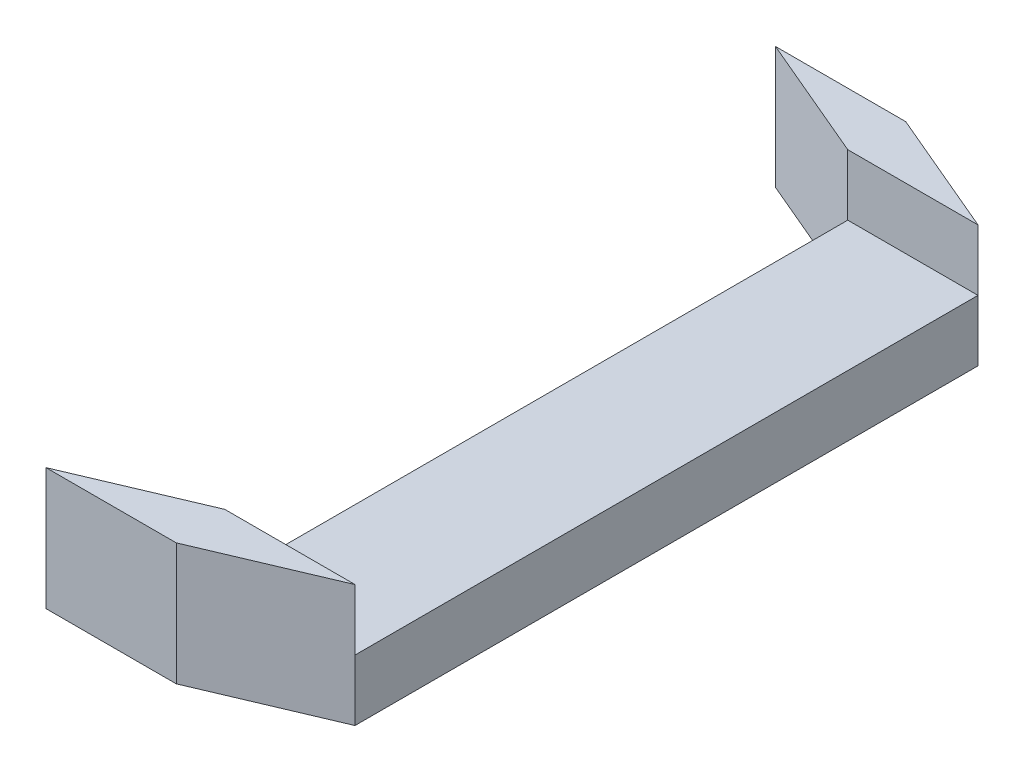
ISO-10303-21;
HEADER;
FILE_DESCRIPTION(('STEP AP214'),'2;1');
FILE_NAME('part.step','',(''),(''),'','','');
FILE_SCHEMA(('AUTOMOTIVE_DESIGN { 1 0 10303 214 1 1 1 1 }'));
ENDSEC;
DATA;
#1=APPLICATION_CONTEXT('core data for automotive mechanical design processes');
#2=APPLICATION_PROTOCOL_DEFINITION('international standard','automotive_design',2000,#1);
#3=PRODUCT_CONTEXT('',#1,'mechanical');
#4=PRODUCT('Part','Part','',(#3));
#5=PRODUCT_RELATED_PRODUCT_CATEGORY('part','',(#4));
#6=PRODUCT_DEFINITION_FORMATION('','',#4);
#7=PRODUCT_DEFINITION_CONTEXT('part definition',#1,'design');
#8=PRODUCT_DEFINITION('design','',#6,#7);
#9=PRODUCT_DEFINITION_SHAPE('','',#8);
#10=(LENGTH_UNIT() NAMED_UNIT(*) SI_UNIT(.MILLI.,.METRE.));
#11=(NAMED_UNIT(*) PLANE_ANGLE_UNIT() SI_UNIT($,.RADIAN.));
#12=(NAMED_UNIT(*) SI_UNIT($,.STERADIAN.) SOLID_ANGLE_UNIT());
#13=UNCERTAINTY_MEASURE_WITH_UNIT(LENGTH_MEASURE(1.E-05),#10,'distance_accuracy_value','');
#14=(GEOMETRIC_REPRESENTATION_CONTEXT(3) GLOBAL_UNCERTAINTY_ASSIGNED_CONTEXT((#13)) GLOBAL_UNIT_ASSIGNED_CONTEXT((#10,
#11,#12)) REPRESENTATION_CONTEXT('',''));
#15=CARTESIAN_POINT('',(0.,0.,0.));
#16=DIRECTION('',(0.,0.,1.));
#17=DIRECTION('',(1.,0.,0.));
#18=AXIS2_PLACEMENT_3D('',#15,#16,#17);
#19=CARTESIAN_POINT('',(3.2,3.,0.));
#20=DIRECTION('',(1.,0.,0.));
#21=DIRECTION('',(0.,0.,-1.));
#22=AXIS2_PLACEMENT_3D('',#19,#20,#21);
#23=PLANE('',#22);
#24=DIRECTION('',(0.,0.,1.));
#25=VECTOR('',#24,1.);
#26=CARTESIAN_POINT('',(3.2,0.,0.));
#27=LINE('',#26,#25);
#28=CARTESIAN_POINT('',(3.2,0.,-15.305));
#29=VERTEX_POINT('',#28);
#30=CARTESIAN_POINT('',(3.2,0.,15.305));
#31=VERTEX_POINT('',#30);
#32=EDGE_CURVE('E176',#29,#31,#27,.T.);
#33=ORIENTED_EDGE('',*,*,#32,.F.);
#34=DIRECTION('',(0.,-1.,0.));
#35=VECTOR('',#34,1.);
#36=CARTESIAN_POINT('',(3.2,3.,-15.305));
#37=LINE('',#36,#35);
#38=CARTESIAN_POINT('',(3.2,3.,-15.305));
#39=VERTEX_POINT('',#38);
#40=EDGE_CURVE('E11',#39,#29,#37,.T.);
#41=ORIENTED_EDGE('',*,*,#40,.F.);
#42=DIRECTION('',(0.,0.,1.));
#43=VECTOR('',#42,1.);
#44=CARTESIAN_POINT('',(3.2,3.,0.));
#45=LINE('',#44,#43);
#46=CARTESIAN_POINT('',(3.2,3.,15.305));
#47=VERTEX_POINT('',#46);
#48=EDGE_CURVE('E177',#39,#47,#45,.T.);
#49=ORIENTED_EDGE('',*,*,#48,.T.);
#50=DIRECTION('',(0.,-1.,0.));
#51=VECTOR('',#50,1.);
#52=CARTESIAN_POINT('',(3.2,3.,15.305));
#53=LINE('',#52,#51);
#54=EDGE_CURVE('E190',#47,#31,#53,.T.);
#55=ORIENTED_EDGE('',*,*,#54,.T.);
#56=EDGE_LOOP('',(#33,#41,#49,#55));
#57=FACE_BOUND('',#56,.T.);
#58=ADVANCED_FACE('F45',(#57),#23,.T.);
#59=CARTESIAN_POINT('',(-3.2,3.,0.));
#60=DIRECTION('',(1.,0.,0.));
#61=DIRECTION('',(0.,0.,-1.));
#62=AXIS2_PLACEMENT_3D('',#59,#60,#61);
#63=PLANE('',#62);
#64=DIRECTION('',(0.,0.,1.));
#65=VECTOR('',#64,1.);
#66=CARTESIAN_POINT('',(-3.2,0.,0.));
#67=LINE('',#66,#65);
#68=CARTESIAN_POINT('',(-3.2,0.,-15.305));
#69=VERTEX_POINT('',#68);
#70=CARTESIAN_POINT('',(-3.2,0.,15.305));
#71=VERTEX_POINT('',#70);
#72=EDGE_CURVE('E181',#69,#71,#67,.T.);
#73=ORIENTED_EDGE('',*,*,#72,.T.);
#74=DIRECTION('',(0.,-1.,0.));
#75=VECTOR('',#74,1.);
#76=CARTESIAN_POINT('',(-3.2,3.,15.305));
#77=LINE('',#76,#75);
#78=CARTESIAN_POINT('',(-3.2,3.,15.305));
#79=VERTEX_POINT('',#78);
#80=EDGE_CURVE('E197',#79,#71,#77,.T.);
#81=ORIENTED_EDGE('',*,*,#80,.F.);
#82=DIRECTION('',(0.,0.,1.));
#83=VECTOR('',#82,1.);
#84=CARTESIAN_POINT('',(-3.2,3.,0.));
#85=LINE('',#84,#83);
#86=CARTESIAN_POINT('',(-3.2,3.,-15.305));
#87=VERTEX_POINT('',#86);
#88=EDGE_CURVE('E184',#87,#79,#85,.T.);
#89=ORIENTED_EDGE('',*,*,#88,.F.);
#90=DIRECTION('',(0.,-1.,0.));
#91=VECTOR('',#90,1.);
#92=CARTESIAN_POINT('',(-3.2,3.,-15.305));
#93=LINE('',#92,#91);
#94=EDGE_CURVE('E52',#87,#69,#93,.T.);
#95=ORIENTED_EDGE('',*,*,#94,.T.);
#96=EDGE_LOOP('',(#73,#81,#89,#95));
#97=FACE_BOUND('',#96,.T.);
#98=ADVANCED_FACE('F202',(#97),#63,.F.);
#99=CARTESIAN_POINT('',(0.,3.,0.));
#100=DIRECTION('',(0.,1.,0.));
#101=DIRECTION('',(0.,0.,1.));
#102=AXIS2_PLACEMENT_3D('',#99,#100,#101);
#103=PLANE('',#102);
#104=ORIENTED_EDGE('',*,*,#48,.F.);
#105=DIRECTION('',(-1.,0.,0.));
#106=VECTOR('',#105,1.);
#107=CARTESIAN_POINT('',(0.,3.,-15.305));
#108=LINE('',#107,#106);
#109=EDGE_CURVE('E180',#39,#87,#108,.T.);
#110=ORIENTED_EDGE('',*,*,#109,.T.);
#111=ORIENTED_EDGE('',*,*,#88,.T.);
#112=DIRECTION('',(1.,0.,0.));
#113=VECTOR('',#112,1.);
#114=CARTESIAN_POINT('',(0.,3.,15.305));
#115=LINE('',#114,#113);
#116=EDGE_CURVE('E187',#79,#47,#115,.T.);
#117=ORIENTED_EDGE('',*,*,#116,.T.);
#118=EDGE_LOOP('',(#104,#110,#111,#117));
#119=FACE_BOUND('',#118,.T.);
#120=ADVANCED_FACE('F217',(#119),#103,.T.);
#121=CARTESIAN_POINT('',(0.,0.,0.));
#122=DIRECTION('',(0.,1.,0.));
#123=DIRECTION('',(0.,0.,1.));
#124=AXIS2_PLACEMENT_3D('',#121,#122,#123);
#125=PLANE('',#124);
#126=ORIENTED_EDGE('',*,*,#32,.T.);
#127=DIRECTION('',(-0.92050485345244,0.,0.390731128489274));
#128=VECTOR('',#127,1.);
#129=CARTESIAN_POINT('',(5.99329442935714,0.,14.1193168604793));
#130=LINE('',#129,#128);
#131=CARTESIAN_POINT('',(-2.96615493768854,0.,17.9223774838953));
#132=VERTEX_POINT('',#131);
#133=EDGE_CURVE('E145',#31,#132,#130,.T.);
#134=ORIENTED_EDGE('',*,*,#133,.T.);
#135=DIRECTION('',(-1.,0.,0.));
#136=VECTOR('',#135,1.);
#137=CARTESIAN_POINT('',(0.,0.,17.9223774838953));
#138=LINE('',#137,#136);
#139=CARTESIAN_POINT('',(-9.36615493768854,0.,17.9223774838953));
#140=VERTEX_POINT('',#139);
#141=EDGE_CURVE('E157',#132,#140,#138,.T.);
#142=ORIENTED_EDGE('',*,*,#141,.T.);
#143=DIRECTION('',(-0.92050485345244,0.,0.390731128489274));
#144=VECTOR('',#143,1.);
#145=CARTESIAN_POINT('',(5.01620121482593,0.,11.8174294993956));
#146=LINE('',#145,#144);
#147=EDGE_CURVE('E148',#71,#140,#146,.T.);
#148=ORIENTED_EDGE('',*,*,#147,.F.);
#149=ORIENTED_EDGE('',*,*,#72,.F.);
#150=DIRECTION('',(-0.92050485345244,0.,-0.390731128489275));
#151=VECTOR('',#150,1.);
#152=CARTESIAN_POINT('',(5.01620121482593,0.,-11.8174294993956));
#153=LINE('',#152,#151);
#154=CARTESIAN_POINT('',(-9.36615493768854,0.,-17.9223774838953));
#155=VERTEX_POINT('',#154);
#156=EDGE_CURVE('E140',#69,#155,#153,.T.);
#157=ORIENTED_EDGE('',*,*,#156,.T.);
#158=DIRECTION('',(-1.,0.,0.));
#159=VECTOR('',#158,1.);
#160=CARTESIAN_POINT('',(0.,0.,-17.9223774838953));
#161=LINE('',#160,#159);
#162=CARTESIAN_POINT('',(-2.96615493768854,0.,-17.9223774838953));
#163=VERTEX_POINT('',#162);
#164=EDGE_CURVE('E224',#163,#155,#161,.T.);
#165=ORIENTED_EDGE('',*,*,#164,.F.);
#166=DIRECTION('',(-0.92050485345244,0.,-0.390731128489275));
#167=VECTOR('',#166,1.);
#168=CARTESIAN_POINT('',(5.99329442935715,0.,-14.1193168604793));
#169=LINE('',#168,#167);
#170=EDGE_CURVE('E144',#29,#163,#169,.T.);
#171=ORIENTED_EDGE('',*,*,#170,.F.);
#172=EDGE_LOOP('',(#126,#134,#142,#148,#149,#157,#165,#171));
#173=FACE_BOUND('',#172,.T.);
#174=ADVANCED_FACE('F208',(#173),#125,.F.);
#175=CARTESIAN_POINT('',(0.,6.,15.305));
#176=DIRECTION('',(0.,0.,-1.));
#177=DIRECTION('',(-1.,0.,0.));
#178=AXIS2_PLACEMENT_3D('',#175,#176,#177);
#179=PLANE('',#178);
#180=ORIENTED_EDGE('',*,*,#116,.F.);
#181=DIRECTION('',(0.,-1.,0.));
#182=VECTOR('',#181,1.);
#183=CARTESIAN_POINT('',(-3.2,6.,15.305));
#184=LINE('',#183,#182);
#185=CARTESIAN_POINT('',(-3.2,6.,15.305));
#186=VERTEX_POINT('',#185);
#187=EDGE_CURVE('E172',#186,#79,#184,.T.);
#188=ORIENTED_EDGE('',*,*,#187,.F.);
#189=DIRECTION('',(1.,0.,0.));
#190=VECTOR('',#189,1.);
#191=CARTESIAN_POINT('',(0.,6.,15.305));
#192=LINE('',#191,#190);
#193=CARTESIAN_POINT('',(3.2,6.,15.305));
#194=VERTEX_POINT('',#193);
#195=EDGE_CURVE('E156',#186,#194,#192,.T.);
#196=ORIENTED_EDGE('',*,*,#195,.T.);
#197=DIRECTION('',(0.,-1.,0.));
#198=VECTOR('',#197,1.);
#199=CARTESIAN_POINT('',(3.2,6.,15.305));
#200=LINE('',#199,#198);
#201=EDGE_CURVE('E59',#194,#47,#200,.T.);
#202=ORIENTED_EDGE('',*,*,#201,.T.);
#203=EDGE_LOOP('',(#180,#188,#196,#202));
#204=FACE_BOUND('',#203,.T.);
#205=ADVANCED_FACE('F250',(#204),#179,.T.);
#206=CARTESIAN_POINT('',(5.99329442935714,6.,14.1193168604793));
#207=DIRECTION('',(0.390731128489274,0.,0.92050485345244));
#208=DIRECTION('',(0.92050485345244,0.,-0.390731128489274));
#209=AXIS2_PLACEMENT_3D('',#206,#207,#208);
#210=PLANE('',#209);
#211=ORIENTED_EDGE('',*,*,#133,.F.);
#212=ORIENTED_EDGE('',*,*,#54,.F.);
#213=ORIENTED_EDGE('',*,*,#201,.F.);
#214=DIRECTION('',(-0.92050485345244,0.,0.390731128489274));
#215=VECTOR('',#214,1.);
#216=CARTESIAN_POINT('',(5.99329442935714,6.,14.1193168604793));
#217=LINE('',#216,#215);
#218=CARTESIAN_POINT('',(-2.96615493768854,6.,17.9223774838953));
#219=VERTEX_POINT('',#218);
#220=EDGE_CURVE('E153',#194,#219,#217,.T.);
#221=ORIENTED_EDGE('',*,*,#220,.T.);
#222=DIRECTION('',(0.,-1.,0.));
#223=VECTOR('',#222,1.);
#224=CARTESIAN_POINT('',(-2.96615493768854,6.,17.9223774838953));
#225=LINE('',#224,#223);
#226=EDGE_CURVE('E163',#219,#132,#225,.T.);
#227=ORIENTED_EDGE('',*,*,#226,.T.);
#228=EDGE_LOOP('',(#211,#212,#213,#221,#227));
#229=FACE_BOUND('',#228,.T.);
#230=ADVANCED_FACE('F252',(#229),#210,.T.);
#231=CARTESIAN_POINT('',(5.01620121482593,6.,11.8174294993956));
#232=DIRECTION('',(0.390731128489274,0.,0.92050485345244));
#233=DIRECTION('',(0.92050485345244,0.,-0.390731128489274));
#234=AXIS2_PLACEMENT_3D('',#231,#232,#233);
#235=PLANE('',#234);
#236=ORIENTED_EDGE('',*,*,#147,.T.);
#237=DIRECTION('',(0.,-1.,0.));
#238=VECTOR('',#237,1.);
#239=CARTESIAN_POINT('',(-9.36615493768854,6.,17.9223774838953));
#240=LINE('',#239,#238);
#241=CARTESIAN_POINT('',(-9.36615493768854,6.,17.9223774838953));
#242=VERTEX_POINT('',#241);
#243=EDGE_CURVE('E170',#242,#140,#240,.T.);
#244=ORIENTED_EDGE('',*,*,#243,.F.);
#245=DIRECTION('',(-0.92050485345244,0.,0.390731128489274));
#246=VECTOR('',#245,1.);
#247=CARTESIAN_POINT('',(5.01620121482593,6.,11.8174294993956));
#248=LINE('',#247,#246);
#249=EDGE_CURVE('E159',#186,#242,#248,.T.);
#250=ORIENTED_EDGE('',*,*,#249,.F.);
#251=ORIENTED_EDGE('',*,*,#187,.T.);
#252=ORIENTED_EDGE('',*,*,#80,.T.);
#253=EDGE_LOOP('',(#236,#244,#250,#251,#252));
#254=FACE_BOUND('',#253,.T.);
#255=ADVANCED_FACE('F212',(#254),#235,.F.);
#256=CARTESIAN_POINT('',(0.,6.,17.9223774838953));
#257=DIRECTION('',(0.,0.,1.));
#258=DIRECTION('',(1.,0.,0.));
#259=AXIS2_PLACEMENT_3D('',#256,#257,#258);
#260=PLANE('',#259);
#261=ORIENTED_EDGE('',*,*,#141,.F.);
#262=ORIENTED_EDGE('',*,*,#226,.F.);
#263=DIRECTION('',(-1.,0.,0.));
#264=VECTOR('',#263,1.);
#265=CARTESIAN_POINT('',(0.,6.,17.9223774838953));
#266=LINE('',#265,#264);
#267=EDGE_CURVE('E161',#219,#242,#266,.T.);
#268=ORIENTED_EDGE('',*,*,#267,.T.);
#269=ORIENTED_EDGE('',*,*,#243,.T.);
#270=EDGE_LOOP('',(#261,#262,#268,#269));
#271=FACE_BOUND('',#270,.T.);
#272=ADVANCED_FACE('F260',(#271),#260,.T.);
#273=CARTESIAN_POINT('',(0.,6.,0.));
#274=DIRECTION('',(0.,1.,0.));
#275=DIRECTION('',(0.,0.,1.));
#276=AXIS2_PLACEMENT_3D('',#273,#274,#275);
#277=PLANE('',#276);
#278=ORIENTED_EDGE('',*,*,#220,.F.);
#279=ORIENTED_EDGE('',*,*,#195,.F.);
#280=ORIENTED_EDGE('',*,*,#249,.T.);
#281=ORIENTED_EDGE('',*,*,#267,.F.);
#282=EDGE_LOOP('',(#278,#279,#280,#281));
#283=FACE_BOUND('',#282,.T.);
#284=ADVANCED_FACE('F263',(#283),#277,.T.);
#285=CARTESIAN_POINT('',(0.,6.,-15.305));
#286=DIRECTION('',(0.,0.,1.));
#287=DIRECTION('',(1.,0.,0.));
#288=AXIS2_PLACEMENT_3D('',#285,#286,#287);
#289=PLANE('',#288);
#290=ORIENTED_EDGE('',*,*,#109,.F.);
#291=DIRECTION('',(0.,-1.,0.));
#292=VECTOR('',#291,1.);
#293=CARTESIAN_POINT('',(3.2,6.,-15.305));
#294=LINE('',#293,#292);
#295=CARTESIAN_POINT('',(3.2,6.,-15.305));
#296=VERTEX_POINT('',#295);
#297=EDGE_CURVE('E219',#296,#39,#294,.T.);
#298=ORIENTED_EDGE('',*,*,#297,.F.);
#299=DIRECTION('',(-1.,0.,0.));
#300=VECTOR('',#299,1.);
#301=CARTESIAN_POINT('',(0.,6.,-15.305));
#302=LINE('',#301,#300);
#303=CARTESIAN_POINT('',(-3.2,6.,-15.305));
#304=VERTEX_POINT('',#303);
#305=EDGE_CURVE('E137',#296,#304,#302,.T.);
#306=ORIENTED_EDGE('',*,*,#305,.T.);
#307=DIRECTION('',(0.,-1.,0.));
#308=VECTOR('',#307,1.);
#309=CARTESIAN_POINT('',(-3.2,6.,-15.305));
#310=LINE('',#309,#308);
#311=EDGE_CURVE('E67',#304,#87,#310,.T.);
#312=ORIENTED_EDGE('',*,*,#311,.T.);
#313=EDGE_LOOP('',(#290,#298,#306,#312));
#314=FACE_BOUND('',#313,.T.);
#315=ADVANCED_FACE('F218',(#314),#289,.T.);
#316=CARTESIAN_POINT('',(5.99329442935715,6.,-14.1193168604793));
#317=DIRECTION('',(-0.390731128489275,0.,0.92050485345244));
#318=DIRECTION('',(0.92050485345244,0.,0.390731128489275));
#319=AXIS2_PLACEMENT_3D('',#316,#317,#318);
#320=PLANE('',#319);
#321=ORIENTED_EDGE('',*,*,#170,.T.);
#322=DIRECTION('',(0.,-1.,0.));
#323=VECTOR('',#322,1.);
#324=CARTESIAN_POINT('',(-2.96615493768854,6.,-17.9223774838953));
#325=LINE('',#324,#323);
#326=CARTESIAN_POINT('',(-2.96615493768854,6.,-17.9223774838953));
#327=VERTEX_POINT('',#326);
#328=EDGE_CURVE('E125',#327,#163,#325,.T.);
#329=ORIENTED_EDGE('',*,*,#328,.F.);
#330=DIRECTION('',(-0.92050485345244,0.,-0.390731128489275));
#331=VECTOR('',#330,1.);
#332=CARTESIAN_POINT('',(5.99329442935715,6.,-14.1193168604793));
#333=LINE('',#332,#331);
#334=EDGE_CURVE('E132',#296,#327,#333,.T.);
#335=ORIENTED_EDGE('',*,*,#334,.F.);
#336=ORIENTED_EDGE('',*,*,#297,.T.);
#337=ORIENTED_EDGE('',*,*,#40,.T.);
#338=EDGE_LOOP('',(#321,#329,#335,#336,#337));
#339=FACE_BOUND('',#338,.T.);
#340=ADVANCED_FACE('F142',(#339),#320,.F.);
#341=CARTESIAN_POINT('',(0.,6.,-17.9223774838953));
#342=DIRECTION('',(0.,0.,1.));
#343=DIRECTION('',(1.,0.,0.));
#344=AXIS2_PLACEMENT_3D('',#341,#342,#343);
#345=PLANE('',#344);
#346=ORIENTED_EDGE('',*,*,#164,.T.);
#347=DIRECTION('',(0.,-1.,0.));
#348=VECTOR('',#347,1.);
#349=CARTESIAN_POINT('',(-9.36615493768854,6.,-17.9223774838953));
#350=LINE('',#349,#348);
#351=CARTESIAN_POINT('',(-9.36615493768854,6.,-17.9223774838953));
#352=VERTEX_POINT('',#351);
#353=EDGE_CURVE('E127',#352,#155,#350,.T.);
#354=ORIENTED_EDGE('',*,*,#353,.F.);
#355=DIRECTION('',(-1.,0.,0.));
#356=VECTOR('',#355,1.);
#357=CARTESIAN_POINT('',(0.,6.,-17.9223774838953));
#358=LINE('',#357,#356);
#359=EDGE_CURVE('E120',#327,#352,#358,.T.);
#360=ORIENTED_EDGE('',*,*,#359,.F.);
#361=ORIENTED_EDGE('',*,*,#328,.T.);
#362=EDGE_LOOP('',(#346,#354,#360,#361));
#363=FACE_BOUND('',#362,.T.);
#364=ADVANCED_FACE('F123',(#363),#345,.F.);
#365=CARTESIAN_POINT('',(5.01620121482593,6.,-11.8174294993956));
#366=DIRECTION('',(-0.390731128489275,0.,0.92050485345244));
#367=DIRECTION('',(0.92050485345244,0.,0.390731128489275));
#368=AXIS2_PLACEMENT_3D('',#365,#366,#367);
#369=PLANE('',#368);
#370=ORIENTED_EDGE('',*,*,#156,.F.);
#371=ORIENTED_EDGE('',*,*,#94,.F.);
#372=ORIENTED_EDGE('',*,*,#311,.F.);
#373=DIRECTION('',(-0.92050485345244,0.,-0.390731128489275));
#374=VECTOR('',#373,1.);
#375=CARTESIAN_POINT('',(5.01620121482593,6.,-11.8174294993956));
#376=LINE('',#375,#374);
#377=EDGE_CURVE('E131',#304,#352,#376,.T.);
#378=ORIENTED_EDGE('',*,*,#377,.T.);
#379=ORIENTED_EDGE('',*,*,#353,.T.);
#380=EDGE_LOOP('',(#370,#371,#372,#378,#379));
#381=FACE_BOUND('',#380,.T.);
#382=ADVANCED_FACE('F230',(#381),#369,.T.);
#383=CARTESIAN_POINT('',(0.,6.,0.));
#384=DIRECTION('',(0.,1.,0.));
#385=DIRECTION('',(0.,0.,1.));
#386=AXIS2_PLACEMENT_3D('',#383,#384,#385);
#387=PLANE('',#386);
#388=ORIENTED_EDGE('',*,*,#334,.T.);
#389=ORIENTED_EDGE('',*,*,#359,.T.);
#390=ORIENTED_EDGE('',*,*,#377,.F.);
#391=ORIENTED_EDGE('',*,*,#305,.F.);
#392=EDGE_LOOP('',(#388,#389,#390,#391));
#393=FACE_BOUND('',#392,.T.);
#394=ADVANCED_FACE('F136',(#393),#387,.T.);
#395=CLOSED_SHELL('',(#58,#98,#120,#174,#205,#230,#255,#272,#284,#315,#340,#364,#382,#394));
#396=MANIFOLD_SOLID_BREP('B2',#395);
#397=ADVANCED_BREP_SHAPE_REPRESENTATION('',(#18,#396),#14);
#398=SHAPE_DEFINITION_REPRESENTATION(#9,#397);
ENDSEC;
END-ISO-10303-21;
